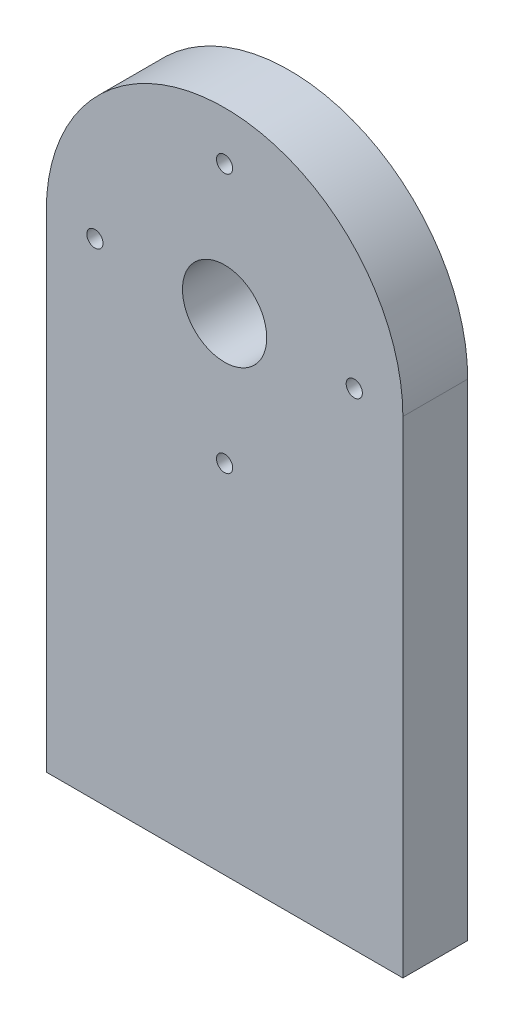
ISO-10303-21;
HEADER;
FILE_DESCRIPTION(('STEP AP214'),'2;1');
FILE_NAME('part.step','',(''),(''),'','','');
FILE_SCHEMA(('AUTOMOTIVE_DESIGN { 1 0 10303 214 1 1 1 1 }'));
ENDSEC;
DATA;
#1=APPLICATION_CONTEXT('core data for automotive mechanical design processes');
#2=APPLICATION_PROTOCOL_DEFINITION('international standard','automotive_design',2000,#1);
#3=PRODUCT_CONTEXT('',#1,'mechanical');
#4=PRODUCT('Part','Part','',(#3));
#5=PRODUCT_RELATED_PRODUCT_CATEGORY('part','',(#4));
#6=PRODUCT_DEFINITION_FORMATION('','',#4);
#7=PRODUCT_DEFINITION_CONTEXT('part definition',#1,'design');
#8=PRODUCT_DEFINITION('design','',#6,#7);
#9=PRODUCT_DEFINITION_SHAPE('','',#8);
#10=(LENGTH_UNIT() NAMED_UNIT(*) SI_UNIT(.MILLI.,.METRE.));
#11=(NAMED_UNIT(*) PLANE_ANGLE_UNIT() SI_UNIT($,.RADIAN.));
#12=(NAMED_UNIT(*) SI_UNIT($,.STERADIAN.) SOLID_ANGLE_UNIT());
#13=UNCERTAINTY_MEASURE_WITH_UNIT(LENGTH_MEASURE(1.E-05),#10,'distance_accuracy_value','');
#14=(GEOMETRIC_REPRESENTATION_CONTEXT(3) GLOBAL_UNCERTAINTY_ASSIGNED_CONTEXT((#13)) GLOBAL_UNIT_ASSIGNED_CONTEXT((#10,
#11,#12)) REPRESENTATION_CONTEXT('',''));
#15=CARTESIAN_POINT('',(0.,0.,0.));
#16=DIRECTION('',(0.,0.,1.));
#17=DIRECTION('',(1.,0.,0.));
#18=AXIS2_PLACEMENT_3D('',#15,#16,#17);
#19=CARTESIAN_POINT('',(-2.25146198830407,150.,20.));
#20=DIRECTION('',(0.,0.,-1.));
#21=DIRECTION('',(-1.,0.,0.));
#22=AXIS2_PLACEMENT_3D('',#19,#20,#21);
#23=PLANE('',#22);
#24=CARTESIAN_POINT('',(-2.25146198830407,190.,20.));
#25=DIRECTION('',(0.,0.,1.));
#26=DIRECTION('',(1.,0.,0.));
#27=AXIS2_PLACEMENT_3D('',#24,#25,#26);
#28=CIRCLE('',#27,2.5);
#29=CARTESIAN_POINT('',(0.248538011695931,190.,20.));
#30=VERTEX_POINT('',#29);
#31=EDGE_CURVE('E156',#30,#30,#28,.T.);
#32=ORIENTED_EDGE('',*,*,#31,.F.);
#33=EDGE_LOOP('',(#32));
#34=FACE_BOUND('',#33,.T.);
#35=CARTESIAN_POINT('',(37.7485380116959,150.,20.));
#36=DIRECTION('',(0.,0.,1.));
#37=DIRECTION('',(1.,0.,0.));
#38=AXIS2_PLACEMENT_3D('',#35,#36,#37);
#39=CIRCLE('',#38,2.5);
#40=CARTESIAN_POINT('',(40.2485380116959,150.,20.));
#41=VERTEX_POINT('',#40);
#42=EDGE_CURVE('E167',#41,#41,#39,.T.);
#43=ORIENTED_EDGE('',*,*,#42,.F.);
#44=EDGE_LOOP('',(#43));
#45=FACE_BOUND('',#44,.T.);
#46=CARTESIAN_POINT('',(-2.25146198830407,110.,20.));
#47=DIRECTION('',(0.,0.,1.));
#48=DIRECTION('',(1.,0.,0.));
#49=AXIS2_PLACEMENT_3D('',#46,#47,#48);
#50=CIRCLE('',#49,2.5);
#51=CARTESIAN_POINT('',(0.248538011695931,110.,20.));
#52=VERTEX_POINT('',#51);
#53=EDGE_CURVE('E103',#52,#52,#50,.T.);
#54=ORIENTED_EDGE('',*,*,#53,.F.);
#55=EDGE_LOOP('',(#54));
#56=FACE_BOUND('',#55,.T.);
#57=CARTESIAN_POINT('',(-42.2514619883041,150.,20.));
#58=DIRECTION('',(0.,0.,1.));
#59=DIRECTION('',(1.,0.,0.));
#60=AXIS2_PLACEMENT_3D('',#57,#58,#59);
#61=CIRCLE('',#60,2.5);
#62=CARTESIAN_POINT('',(-39.7514619883041,150.,20.));
#63=VERTEX_POINT('',#62);
#64=EDGE_CURVE('E96',#63,#63,#61,.T.);
#65=ORIENTED_EDGE('',*,*,#64,.F.);
#66=EDGE_LOOP('',(#65));
#67=FACE_BOUND('',#66,.T.);
#68=DIRECTION('',(0.,-1.,0.));
#69=VECTOR('',#68,1.);
#70=CARTESIAN_POINT('',(-57.2514619883041,0.,20.));
#71=LINE('',#70,#69);
#72=CARTESIAN_POINT('',(-57.2514619883041,150.,20.));
#73=VERTEX_POINT('',#72);
#74=CARTESIAN_POINT('',(-57.2514619883041,0.,20.));
#75=VERTEX_POINT('',#74);
#76=EDGE_CURVE('E113',#73,#75,#71,.T.);
#77=ORIENTED_EDGE('',*,*,#76,.T.);
#78=DIRECTION('',(1.,0.,0.));
#79=VECTOR('',#78,1.);
#80=CARTESIAN_POINT('',(-57.2514619883041,0.,20.));
#81=LINE('',#80,#79);
#82=CARTESIAN_POINT('',(52.7485380116959,0.,20.));
#83=VERTEX_POINT('',#82);
#84=EDGE_CURVE('E116',#75,#83,#81,.T.);
#85=ORIENTED_EDGE('',*,*,#84,.T.);
#86=DIRECTION('',(0.,1.,0.));
#87=VECTOR('',#86,1.);
#88=CARTESIAN_POINT('',(52.7485380116959,0.,20.));
#89=LINE('',#88,#87);
#90=CARTESIAN_POINT('',(52.7485380116959,150.,20.));
#91=VERTEX_POINT('',#90);
#92=EDGE_CURVE('E119',#83,#91,#89,.T.);
#93=ORIENTED_EDGE('',*,*,#92,.T.);
#94=CARTESIAN_POINT('',(-2.25146198830407,150.,20.));
#95=DIRECTION('',(0.,0.,1.));
#96=DIRECTION('',(-1.,0.,0.));
#97=AXIS2_PLACEMENT_3D('',#94,#95,#96);
#98=CIRCLE('',#97,55.);
#99=EDGE_CURVE('E121',#91,#73,#98,.T.);
#100=ORIENTED_EDGE('',*,*,#99,.T.);
#101=EDGE_LOOP('',(#77,#85,#93,#100));
#102=FACE_BOUND('',#101,.T.);
#103=CARTESIAN_POINT('',(-2.25146198830407,150.,20.));
#104=DIRECTION('',(0.,0.,1.));
#105=DIRECTION('',(1.,0.,0.));
#106=AXIS2_PLACEMENT_3D('',#103,#104,#105);
#107=CIRCLE('',#106,13.);
#108=CARTESIAN_POINT('',(10.7485380116959,150.,20.));
#109=VERTEX_POINT('',#108);
#110=EDGE_CURVE('E107',#109,#109,#107,.T.);
#111=ORIENTED_EDGE('',*,*,#110,.F.);
#112=EDGE_LOOP('',(#111));
#113=FACE_BOUND('',#112,.T.);
#114=ADVANCED_FACE('F33',(#34,#45,#56,#67,#102,#113),#23,.F.);
#115=CARTESIAN_POINT('',(-2.25146198830407,150.,0.));
#116=DIRECTION('',(0.,0.,-1.));
#117=DIRECTION('',(-1.,0.,0.));
#118=AXIS2_PLACEMENT_3D('',#115,#116,#117);
#119=PLANE('',#118);
#120=CARTESIAN_POINT('',(-2.25146198830407,190.,0.));
#121=DIRECTION('',(0.,0.,1.));
#122=DIRECTION('',(1.,0.,0.));
#123=AXIS2_PLACEMENT_3D('',#120,#121,#122);
#124=CIRCLE('',#123,2.5);
#125=CARTESIAN_POINT('',(0.248538011695928,190.,0.));
#126=VERTEX_POINT('',#125);
#127=EDGE_CURVE('E160',#126,#126,#124,.T.);
#128=ORIENTED_EDGE('',*,*,#127,.T.);
#129=EDGE_LOOP('',(#128));
#130=FACE_BOUND('',#129,.T.);
#131=CARTESIAN_POINT('',(37.7485380116959,150.,0.));
#132=DIRECTION('',(0.,0.,1.));
#133=DIRECTION('',(1.,0.,0.));
#134=AXIS2_PLACEMENT_3D('',#131,#132,#133);
#135=CIRCLE('',#134,2.5);
#136=CARTESIAN_POINT('',(40.2485380116959,150.,0.));
#137=VERTEX_POINT('',#136);
#138=EDGE_CURVE('E170',#137,#137,#135,.T.);
#139=ORIENTED_EDGE('',*,*,#138,.T.);
#140=EDGE_LOOP('',(#139));
#141=FACE_BOUND('',#140,.T.);
#142=CARTESIAN_POINT('',(-2.25146198830407,110.,0.));
#143=DIRECTION('',(0.,0.,1.));
#144=DIRECTION('',(1.,0.,0.));
#145=AXIS2_PLACEMENT_3D('',#142,#143,#144);
#146=CIRCLE('',#145,2.5);
#147=CARTESIAN_POINT('',(0.248538011695928,110.,0.));
#148=VERTEX_POINT('',#147);
#149=EDGE_CURVE('E98',#148,#148,#146,.T.);
#150=ORIENTED_EDGE('',*,*,#149,.T.);
#151=EDGE_LOOP('',(#150));
#152=FACE_BOUND('',#151,.T.);
#153=CARTESIAN_POINT('',(-42.2514619883041,150.,0.));
#154=DIRECTION('',(0.,0.,1.));
#155=DIRECTION('',(1.,0.,0.));
#156=AXIS2_PLACEMENT_3D('',#153,#154,#155);
#157=CIRCLE('',#156,2.5);
#158=CARTESIAN_POINT('',(-39.7514619883041,150.,0.));
#159=VERTEX_POINT('',#158);
#160=EDGE_CURVE('E93',#159,#159,#157,.T.);
#161=ORIENTED_EDGE('',*,*,#160,.T.);
#162=EDGE_LOOP('',(#161));
#163=FACE_BOUND('',#162,.T.);
#164=DIRECTION('',(0.,-1.,0.));
#165=VECTOR('',#164,1.);
#166=CARTESIAN_POINT('',(-57.2514619883041,0.,0.));
#167=LINE('',#166,#165);
#168=CARTESIAN_POINT('',(-57.2514619883041,150.,0.));
#169=VERTEX_POINT('',#168);
#170=CARTESIAN_POINT('',(-57.2514619883041,0.,0.));
#171=VERTEX_POINT('',#170);
#172=EDGE_CURVE('E110',#169,#171,#167,.T.);
#173=ORIENTED_EDGE('',*,*,#172,.F.);
#174=CARTESIAN_POINT('',(-2.25146198830407,150.,0.));
#175=DIRECTION('',(0.,0.,1.));
#176=DIRECTION('',(-1.,0.,0.));
#177=AXIS2_PLACEMENT_3D('',#174,#175,#176);
#178=CIRCLE('',#177,55.);
#179=CARTESIAN_POINT('',(52.7485380116959,150.,0.));
#180=VERTEX_POINT('',#179);
#181=EDGE_CURVE('E117',#180,#169,#178,.T.);
#182=ORIENTED_EDGE('',*,*,#181,.F.);
#183=DIRECTION('',(0.,1.,0.));
#184=VECTOR('',#183,1.);
#185=CARTESIAN_POINT('',(52.7485380116959,0.,0.));
#186=LINE('',#185,#184);
#187=CARTESIAN_POINT('',(52.7485380116959,0.,0.));
#188=VERTEX_POINT('',#187);
#189=EDGE_CURVE('E128',#188,#180,#186,.T.);
#190=ORIENTED_EDGE('',*,*,#189,.F.);
#191=DIRECTION('',(1.,0.,0.));
#192=VECTOR('',#191,1.);
#193=CARTESIAN_POINT('',(-57.2514619883041,0.,0.));
#194=LINE('',#193,#192);
#195=EDGE_CURVE('E126',#171,#188,#194,.T.);
#196=ORIENTED_EDGE('',*,*,#195,.F.);
#197=EDGE_LOOP('',(#173,#182,#190,#196));
#198=FACE_BOUND('',#197,.T.);
#199=CARTESIAN_POINT('',(-2.25146198830407,150.,0.));
#200=DIRECTION('',(0.,0.,1.));
#201=DIRECTION('',(1.,0.,0.));
#202=AXIS2_PLACEMENT_3D('',#199,#200,#201);
#203=CIRCLE('',#202,13.);
#204=CARTESIAN_POINT('',(10.7485380116959,150.,0.));
#205=VERTEX_POINT('',#204);
#206=EDGE_CURVE('E100',#205,#205,#203,.T.);
#207=ORIENTED_EDGE('',*,*,#206,.T.);
#208=EDGE_LOOP('',(#207));
#209=FACE_BOUND('',#208,.T.);
#210=ADVANCED_FACE('F177',(#130,#141,#152,#163,#198,#209),#119,.T.);
#211=CARTESIAN_POINT('',(-57.2514619883041,0.,20.));
#212=DIRECTION('',(1.,0.,0.));
#213=DIRECTION('',(0.,0.,-1.));
#214=AXIS2_PLACEMENT_3D('',#211,#212,#213);
#215=PLANE('',#214);
#216=ORIENTED_EDGE('',*,*,#172,.T.);
#217=DIRECTION('',(0.,0.,-1.));
#218=VECTOR('',#217,1.);
#219=CARTESIAN_POINT('',(-57.2514619883041,0.,20.));
#220=LINE('',#219,#218);
#221=EDGE_CURVE('E139',#75,#171,#220,.T.);
#222=ORIENTED_EDGE('',*,*,#221,.F.);
#223=ORIENTED_EDGE('',*,*,#76,.F.);
#224=DIRECTION('',(0.,0.,-1.));
#225=VECTOR('',#224,1.);
#226=CARTESIAN_POINT('',(-57.2514619883041,150.,20.));
#227=LINE('',#226,#225);
#228=EDGE_CURVE('E123',#73,#169,#227,.T.);
#229=ORIENTED_EDGE('',*,*,#228,.T.);
#230=EDGE_LOOP('',(#216,#222,#223,#229));
#231=FACE_BOUND('',#230,.T.);
#232=ADVANCED_FACE('F35',(#231),#215,.F.);
#233=CARTESIAN_POINT('',(-57.2514619883041,0.,20.));
#234=DIRECTION('',(0.,1.,0.));
#235=DIRECTION('',(0.,0.,1.));
#236=AXIS2_PLACEMENT_3D('',#233,#234,#235);
#237=PLANE('',#236);
#238=CARTESIAN_POINT('',(-42.2514619883041,0.,10.));
#239=DIRECTION('',(0.,-1.,0.));
#240=DIRECTION('',(0.,0.,-1.));
#241=AXIS2_PLACEMENT_3D('',#238,#239,#240);
#242=CIRCLE('',#241,2.49999999999999);
#243=CARTESIAN_POINT('',(-42.2514619883041,0.,7.50000000000001));
#244=VERTEX_POINT('',#243);
#245=EDGE_CURVE('E157',#244,#244,#242,.T.);
#246=ORIENTED_EDGE('',*,*,#245,.F.);
#247=EDGE_LOOP('',(#246));
#248=FACE_BOUND('',#247,.T.);
#249=CARTESIAN_POINT('',(37.7485380116959,0.,10.));
#250=DIRECTION('',(0.,-1.,0.));
#251=DIRECTION('',(0.,0.,-1.));
#252=AXIS2_PLACEMENT_3D('',#249,#250,#251);
#253=CIRCLE('',#252,2.49999999999999);
#254=CARTESIAN_POINT('',(37.7485380116959,0.,7.50000000000001));
#255=VERTEX_POINT('',#254);
#256=EDGE_CURVE('E154',#255,#255,#253,.T.);
#257=ORIENTED_EDGE('',*,*,#256,.F.);
#258=EDGE_LOOP('',(#257));
#259=FACE_BOUND('',#258,.T.);
#260=ORIENTED_EDGE('',*,*,#195,.T.);
#261=DIRECTION('',(0.,0.,-1.));
#262=VECTOR('',#261,1.);
#263=CARTESIAN_POINT('',(52.7485380116959,0.,20.));
#264=LINE('',#263,#262);
#265=EDGE_CURVE('E136',#83,#188,#264,.T.);
#266=ORIENTED_EDGE('',*,*,#265,.F.);
#267=ORIENTED_EDGE('',*,*,#84,.F.);
#268=ORIENTED_EDGE('',*,*,#221,.T.);
#269=EDGE_LOOP('',(#260,#266,#267,#268));
#270=FACE_BOUND('',#269,.T.);
#271=ADVANCED_FACE('F198',(#248,#259,#270),#237,.F.);
#272=CARTESIAN_POINT('',(52.7485380116959,0.,20.));
#273=DIRECTION('',(-1.,0.,0.));
#274=DIRECTION('',(0.,0.,1.));
#275=AXIS2_PLACEMENT_3D('',#272,#273,#274);
#276=PLANE('',#275);
#277=ORIENTED_EDGE('',*,*,#189,.T.);
#278=DIRECTION('',(0.,0.,-1.));
#279=VECTOR('',#278,1.);
#280=CARTESIAN_POINT('',(52.7485380116959,150.,20.));
#281=LINE('',#280,#279);
#282=EDGE_CURVE('E133',#91,#180,#281,.T.);
#283=ORIENTED_EDGE('',*,*,#282,.F.);
#284=ORIENTED_EDGE('',*,*,#92,.F.);
#285=ORIENTED_EDGE('',*,*,#265,.T.);
#286=EDGE_LOOP('',(#277,#283,#284,#285));
#287=FACE_BOUND('',#286,.T.);
#288=ADVANCED_FACE('F204',(#287),#276,.F.);
#289=CARTESIAN_POINT('',(-2.25146198830407,150.,20.));
#290=DIRECTION('',(0.,0.,-1.));
#291=DIRECTION('',(-1.,0.,0.));
#292=AXIS2_PLACEMENT_3D('',#289,#290,#291);
#293=CYLINDRICAL_SURFACE('',#292,55.);
#294=ORIENTED_EDGE('',*,*,#181,.T.);
#295=ORIENTED_EDGE('',*,*,#228,.F.);
#296=ORIENTED_EDGE('',*,*,#99,.F.);
#297=ORIENTED_EDGE('',*,*,#282,.T.);
#298=EDGE_LOOP('',(#294,#295,#296,#297));
#299=FACE_BOUND('',#298,.T.);
#300=ADVANCED_FACE('F188',(#299),#293,.T.);
#301=CARTESIAN_POINT('',(-2.25146198830407,150.,20.));
#302=DIRECTION('',(0.,0.,-1.));
#303=DIRECTION('',(-1.,0.,0.));
#304=AXIS2_PLACEMENT_3D('',#301,#302,#303);
#305=CYLINDRICAL_SURFACE('',#304,13.);
#306=ORIENTED_EDGE('',*,*,#110,.T.);
#307=EDGE_LOOP('',(#306));
#308=FACE_BOUND('',#307,.T.);
#309=ORIENTED_EDGE('',*,*,#206,.F.);
#310=EDGE_LOOP('',(#309));
#311=FACE_BOUND('',#310,.T.);
#312=ADVANCED_FACE('F88',(#308,#311),#305,.F.);
#313=CARTESIAN_POINT('',(-42.2514619883041,150.,20.));
#314=DIRECTION('',(0.,0.,1.));
#315=DIRECTION('',(1.,0.,0.));
#316=AXIS2_PLACEMENT_3D('',#313,#314,#315);
#317=CYLINDRICAL_SURFACE('',#316,2.5);
#318=CARTESIAN_POINT('',(-42.2514619883041,150.,10.));
#319=DIRECTION('',(0.,0.707106781186547,0.707106781186547));
#320=DIRECTION('',(0.,-0.707106781186547,0.707106781186547));
#321=AXIS2_PLACEMENT_3D('',#318,#319,#320);
#322=ELLIPSE('',#321,3.53553390593272,2.49999999999998);
#323=CARTESIAN_POINT('',(-39.7514619883041,150.,10.));
#324=VERTEX_POINT('',#323);
#325=CARTESIAN_POINT('',(-44.7514619883041,150.,10.));
#326=VERTEX_POINT('',#325);
#327=EDGE_CURVE('E41',#324,#326,#322,.F.);
#328=ORIENTED_EDGE('',*,*,#327,.T.);
#329=CARTESIAN_POINT('',(-42.2514619883041,150.,10.));
#330=DIRECTION('',(0.,-0.707106781186547,0.707106781186547));
#331=DIRECTION('',(0.,0.707106781186547,0.707106781186547));
#332=AXIS2_PLACEMENT_3D('',#329,#330,#331);
#333=ELLIPSE('',#332,3.53553390593272,2.49999999999998);
#334=EDGE_CURVE('E11',#326,#324,#333,.T.);
#335=ORIENTED_EDGE('',*,*,#334,.T.);
#336=EDGE_LOOP('',(#328,#335));
#337=FACE_BOUND('',#336,.T.);
#338=ORIENTED_EDGE('',*,*,#160,.F.);
#339=EDGE_LOOP('',(#338));
#340=FACE_BOUND('',#339,.T.);
#341=ORIENTED_EDGE('',*,*,#64,.T.);
#342=EDGE_LOOP('',(#341));
#343=FACE_BOUND('',#342,.T.);
#344=ADVANCED_FACE('F84',(#337,#340,#343),#317,.F.);
#345=CARTESIAN_POINT('',(-2.25146198830407,110.,20.));
#346=DIRECTION('',(0.,0.,1.));
#347=DIRECTION('',(1.,0.,0.));
#348=AXIS2_PLACEMENT_3D('',#345,#346,#347);
#349=CYLINDRICAL_SURFACE('',#348,2.5);
#350=ORIENTED_EDGE('',*,*,#149,.F.);
#351=EDGE_LOOP('',(#350));
#352=FACE_BOUND('',#351,.T.);
#353=ORIENTED_EDGE('',*,*,#53,.T.);
#354=EDGE_LOOP('',(#353));
#355=FACE_BOUND('',#354,.T.);
#356=ADVANCED_FACE('F87',(#352,#355),#349,.F.);
#357=CARTESIAN_POINT('',(37.7485380116959,150.,20.));
#358=DIRECTION('',(0.,0.,1.));
#359=DIRECTION('',(1.,0.,0.));
#360=AXIS2_PLACEMENT_3D('',#357,#358,#359);
#361=CYLINDRICAL_SURFACE('',#360,2.5);
#362=CARTESIAN_POINT('',(37.7485380116959,150.,10.));
#363=DIRECTION('',(0.,0.707106781186547,0.707106781186547));
#364=DIRECTION('',(0.,-0.707106781186547,0.707106781186547));
#365=AXIS2_PLACEMENT_3D('',#362,#363,#364);
#366=ELLIPSE('',#365,3.53553390593272,2.49999999999998);
#367=CARTESIAN_POINT('',(40.2485380116959,150.,10.));
#368=VERTEX_POINT('',#367);
#369=CARTESIAN_POINT('',(35.2485380116959,150.,10.));
#370=VERTEX_POINT('',#369);
#371=EDGE_CURVE('E142',#368,#370,#366,.F.);
#372=ORIENTED_EDGE('',*,*,#371,.T.);
#373=CARTESIAN_POINT('',(37.7485380116959,150.,10.));
#374=DIRECTION('',(0.,-0.707106781186547,0.707106781186547));
#375=DIRECTION('',(0.,0.707106781186547,0.707106781186547));
#376=AXIS2_PLACEMENT_3D('',#373,#374,#375);
#377=ELLIPSE('',#376,3.53553390593272,2.49999999999998);
#378=EDGE_CURVE('E52',#370,#368,#377,.T.);
#379=ORIENTED_EDGE('',*,*,#378,.T.);
#380=EDGE_LOOP('',(#372,#379));
#381=FACE_BOUND('',#380,.T.);
#382=ORIENTED_EDGE('',*,*,#138,.F.);
#383=EDGE_LOOP('',(#382));
#384=FACE_BOUND('',#383,.T.);
#385=ORIENTED_EDGE('',*,*,#42,.T.);
#386=EDGE_LOOP('',(#385));
#387=FACE_BOUND('',#386,.T.);
#388=ADVANCED_FACE('F145',(#381,#384,#387),#361,.F.);
#389=CARTESIAN_POINT('',(-2.25146198830407,190.,20.));
#390=DIRECTION('',(0.,0.,1.));
#391=DIRECTION('',(1.,0.,0.));
#392=AXIS2_PLACEMENT_3D('',#389,#390,#391);
#393=CYLINDRICAL_SURFACE('',#392,2.5);
#394=ORIENTED_EDGE('',*,*,#127,.F.);
#395=EDGE_LOOP('',(#394));
#396=FACE_BOUND('',#395,.T.);
#397=ORIENTED_EDGE('',*,*,#31,.T.);
#398=EDGE_LOOP('',(#397));
#399=FACE_BOUND('',#398,.T.);
#400=ADVANCED_FACE('F150',(#396,#399),#393,.F.);
#401=CARTESIAN_POINT('',(37.7485380116959,0.,10.));
#402=DIRECTION('',(0.,-1.,0.));
#403=DIRECTION('',(0.,0.,-1.));
#404=AXIS2_PLACEMENT_3D('',#401,#402,#403);
#405=CYLINDRICAL_SURFACE('',#404,2.49999999999997);
#406=ORIENTED_EDGE('',*,*,#371,.F.);
#407=ORIENTED_EDGE('',*,*,#378,.F.);
#408=EDGE_LOOP('',(#406,#407));
#409=FACE_BOUND('',#408,.T.);
#410=ORIENTED_EDGE('',*,*,#256,.T.);
#411=EDGE_LOOP('',(#410));
#412=FACE_BOUND('',#411,.T.);
#413=ADVANCED_FACE('F147',(#409,#412),#405,.F.);
#414=CARTESIAN_POINT('',(-42.2514619883041,0.,10.));
#415=DIRECTION('',(0.,-1.,0.));
#416=DIRECTION('',(0.,0.,-1.));
#417=AXIS2_PLACEMENT_3D('',#414,#415,#416);
#418=CYLINDRICAL_SURFACE('',#417,2.49999999999997);
#419=ORIENTED_EDGE('',*,*,#327,.F.);
#420=ORIENTED_EDGE('',*,*,#334,.F.);
#421=EDGE_LOOP('',(#419,#420));
#422=FACE_BOUND('',#421,.T.);
#423=ORIENTED_EDGE('',*,*,#245,.T.);
#424=EDGE_LOOP('',(#423));
#425=FACE_BOUND('',#424,.T.);
#426=ADVANCED_FACE('F81',(#422,#425),#418,.F.);
#427=CLOSED_SHELL('',(#114,#210,#232,#271,#288,#300,#312,#344,#356,#388,#400,#413,#426));
#428=MANIFOLD_SOLID_BREP('B2',#427);
#429=ADVANCED_BREP_SHAPE_REPRESENTATION('',(#18,#428),#14);
#430=SHAPE_DEFINITION_REPRESENTATION(#9,#429);
ENDSEC;
END-ISO-10303-21;
